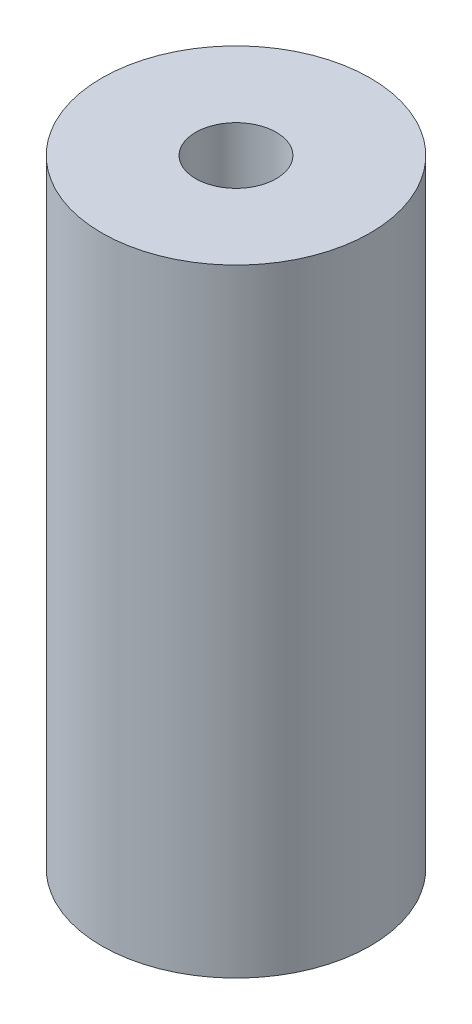
ISO-10303-21;
HEADER;
FILE_DESCRIPTION(('STEP AP214'),'2;1');
FILE_NAME('part.step','',(''),(''),'','','');
FILE_SCHEMA(('AUTOMOTIVE_DESIGN { 1 0 10303 214 1 1 1 1 }'));
ENDSEC;
DATA;
#1=APPLICATION_CONTEXT('core data for automotive mechanical design processes');
#2=APPLICATION_PROTOCOL_DEFINITION('international standard','automotive_design',2000,#1);
#3=PRODUCT_CONTEXT('',#1,'mechanical');
#4=PRODUCT('Part','Part','',(#3));
#5=PRODUCT_RELATED_PRODUCT_CATEGORY('part','',(#4));
#6=PRODUCT_DEFINITION_FORMATION('','',#4);
#7=PRODUCT_DEFINITION_CONTEXT('part definition',#1,'design');
#8=PRODUCT_DEFINITION('design','',#6,#7);
#9=PRODUCT_DEFINITION_SHAPE('','',#8);
#10=(LENGTH_UNIT() NAMED_UNIT(*) SI_UNIT(.MILLI.,.METRE.));
#11=(NAMED_UNIT(*) PLANE_ANGLE_UNIT() SI_UNIT($,.RADIAN.));
#12=(NAMED_UNIT(*) SI_UNIT($,.STERADIAN.) SOLID_ANGLE_UNIT());
#13=UNCERTAINTY_MEASURE_WITH_UNIT(LENGTH_MEASURE(1.E-05),#10,'distance_accuracy_value','');
#14=(GEOMETRIC_REPRESENTATION_CONTEXT(3) GLOBAL_UNCERTAINTY_ASSIGNED_CONTEXT((#13)) GLOBAL_UNIT_ASSIGNED_CONTEXT((#10,
#11,#12)) REPRESENTATION_CONTEXT('',''));
#15=CARTESIAN_POINT('',(0.,0.,0.));
#16=DIRECTION('',(0.,0.,1.));
#17=DIRECTION('',(1.,0.,0.));
#18=AXIS2_PLACEMENT_3D('',#15,#16,#17);
#19=CARTESIAN_POINT('',(0.,23.,0.));
#20=DIRECTION('',(0.,-1.,0.));
#21=DIRECTION('',(0.,0.,-1.));
#22=AXIS2_PLACEMENT_3D('',#19,#20,#21);
#23=CYLINDRICAL_SURFACE('',#22,5.);
#24=CARTESIAN_POINT('',(0.,23.,0.));
#25=DIRECTION('',(0.,1.,0.));
#26=DIRECTION('',(0.,0.,1.));
#27=AXIS2_PLACEMENT_3D('',#24,#25,#26);
#28=CIRCLE('',#27,5.);
#29=CARTESIAN_POINT('',(0.,23.,5.));
#30=VERTEX_POINT('',#29);
#31=EDGE_CURVE('E10',#30,#30,#28,.T.);
#32=ORIENTED_EDGE('',*,*,#31,.F.);
#33=EDGE_LOOP('',(#32));
#34=FACE_BOUND('',#33,.T.);
#35=CARTESIAN_POINT('',(0.,0.,0.));
#36=DIRECTION('',(0.,1.,0.));
#37=DIRECTION('',(0.,0.,1.));
#38=AXIS2_PLACEMENT_3D('',#35,#36,#37);
#39=CIRCLE('',#38,5.);
#40=CARTESIAN_POINT('',(0.,0.,5.));
#41=VERTEX_POINT('',#40);
#42=EDGE_CURVE('E33',#41,#41,#39,.T.);
#43=ORIENTED_EDGE('',*,*,#42,.T.);
#44=EDGE_LOOP('',(#43));
#45=FACE_BOUND('',#44,.T.);
#46=ADVANCED_FACE('F30',(#34,#45),#23,.T.);
#47=CARTESIAN_POINT('',(0.,23.,0.));
#48=DIRECTION('',(0.,1.,0.));
#49=DIRECTION('',(0.,0.,1.));
#50=AXIS2_PLACEMENT_3D('',#47,#48,#49);
#51=PLANE('',#50);
#52=CARTESIAN_POINT('',(0.,23.,0.));
#53=DIRECTION('',(0.,1.,0.));
#54=DIRECTION('',(0.,0.,1.));
#55=AXIS2_PLACEMENT_3D('',#52,#53,#54);
#56=CIRCLE('',#55,1.5);
#57=CARTESIAN_POINT('',(0.,23.,1.5));
#58=VERTEX_POINT('',#57);
#59=EDGE_CURVE('E42',#58,#58,#56,.T.);
#60=ORIENTED_EDGE('',*,*,#59,.F.);
#61=EDGE_LOOP('',(#60));
#62=FACE_BOUND('',#61,.T.);
#63=ORIENTED_EDGE('',*,*,#31,.T.);
#64=EDGE_LOOP('',(#63));
#65=FACE_BOUND('',#64,.T.);
#66=ADVANCED_FACE('F67',(#62,#65),#51,.T.);
#67=CARTESIAN_POINT('',(0.,0.,0.));
#68=DIRECTION('',(0.,1.,0.));
#69=DIRECTION('',(0.,0.,1.));
#70=AXIS2_PLACEMENT_3D('',#67,#68,#69);
#71=PLANE('',#70);
#72=CARTESIAN_POINT('',(0.,0.,0.));
#73=DIRECTION('',(0.,-1.,0.));
#74=DIRECTION('',(0.,0.,-1.));
#75=AXIS2_PLACEMENT_3D('',#72,#73,#74);
#76=CIRCLE('',#75,1.5);
#77=CARTESIAN_POINT('',(0.,0.,-1.5));
#78=VERTEX_POINT('',#77);
#79=EDGE_CURVE('E48',#78,#78,#76,.T.);
#80=ORIENTED_EDGE('',*,*,#79,.F.);
#81=EDGE_LOOP('',(#80));
#82=FACE_BOUND('',#81,.T.);
#83=ORIENTED_EDGE('',*,*,#42,.F.);
#84=EDGE_LOOP('',(#83));
#85=FACE_BOUND('',#84,.T.);
#86=ADVANCED_FACE('F63',(#82,#85),#71,.F.);
#87=CARTESIAN_POINT('',(0.,18.,0.));
#88=DIRECTION('',(0.,1.,0.));
#89=DIRECTION('',(0.,0.,1.));
#90=AXIS2_PLACEMENT_3D('',#87,#88,#89);
#91=CYLINDRICAL_SURFACE('',#90,1.5);
#92=CARTESIAN_POINT('',(0.,18.,0.));
#93=DIRECTION('',(0.,1.,0.));
#94=DIRECTION('',(0.,0.,1.));
#95=AXIS2_PLACEMENT_3D('',#92,#93,#94);
#96=CIRCLE('',#95,1.5);
#97=CARTESIAN_POINT('',(0.,18.,1.5));
#98=VERTEX_POINT('',#97);
#99=EDGE_CURVE('E40',#98,#98,#96,.T.);
#100=ORIENTED_EDGE('',*,*,#99,.F.);
#101=EDGE_LOOP('',(#100));
#102=FACE_BOUND('',#101,.T.);
#103=ORIENTED_EDGE('',*,*,#59,.T.);
#104=EDGE_LOOP('',(#103));
#105=FACE_BOUND('',#104,.T.);
#106=ADVANCED_FACE('F66',(#102,#105),#91,.F.);
#107=CARTESIAN_POINT('',(0.,18.,0.));
#108=DIRECTION('',(0.,1.,0.));
#109=DIRECTION('',(0.,0.,1.));
#110=AXIS2_PLACEMENT_3D('',#107,#108,#109);
#111=PLANE('',#110);
#112=ORIENTED_EDGE('',*,*,#99,.T.);
#113=EDGE_LOOP('',(#112));
#114=FACE_BOUND('',#113,.T.);
#115=ADVANCED_FACE('F59',(#114),#111,.T.);
#116=CARTESIAN_POINT('',(0.,5.,0.));
#117=DIRECTION('',(0.,-1.,0.));
#118=DIRECTION('',(0.,0.,-1.));
#119=AXIS2_PLACEMENT_3D('',#116,#117,#118);
#120=CYLINDRICAL_SURFACE('',#119,1.5);
#121=CARTESIAN_POINT('',(0.,5.,0.));
#122=DIRECTION('',(0.,-1.,0.));
#123=DIRECTION('',(0.,0.,-1.));
#124=AXIS2_PLACEMENT_3D('',#121,#122,#123);
#125=CIRCLE('',#124,1.5);
#126=CARTESIAN_POINT('',(0.,5.,-1.5));
#127=VERTEX_POINT('',#126);
#128=EDGE_CURVE('E45',#127,#127,#125,.T.);
#129=ORIENTED_EDGE('',*,*,#128,.F.);
#130=EDGE_LOOP('',(#129));
#131=FACE_BOUND('',#130,.T.);
#132=ORIENTED_EDGE('',*,*,#79,.T.);
#133=EDGE_LOOP('',(#132));
#134=FACE_BOUND('',#133,.T.);
#135=ADVANCED_FACE('F56',(#131,#134),#120,.F.);
#136=CARTESIAN_POINT('',(0.,5.,0.));
#137=DIRECTION('',(0.,-1.,0.));
#138=DIRECTION('',(0.,0.,-1.));
#139=AXIS2_PLACEMENT_3D('',#136,#137,#138);
#140=PLANE('',#139);
#141=ORIENTED_EDGE('',*,*,#128,.T.);
#142=EDGE_LOOP('',(#141));
#143=FACE_BOUND('',#142,.T.);
#144=ADVANCED_FACE('F54',(#143),#140,.T.);
#145=CLOSED_SHELL('',(#46,#66,#86,#106,#115,#135,#144));
#146=MANIFOLD_SOLID_BREP('B2',#145);
#147=ADVANCED_BREP_SHAPE_REPRESENTATION('',(#18,#146),#14);
#148=SHAPE_DEFINITION_REPRESENTATION(#9,#147);
ENDSEC;
END-ISO-10303-21;
